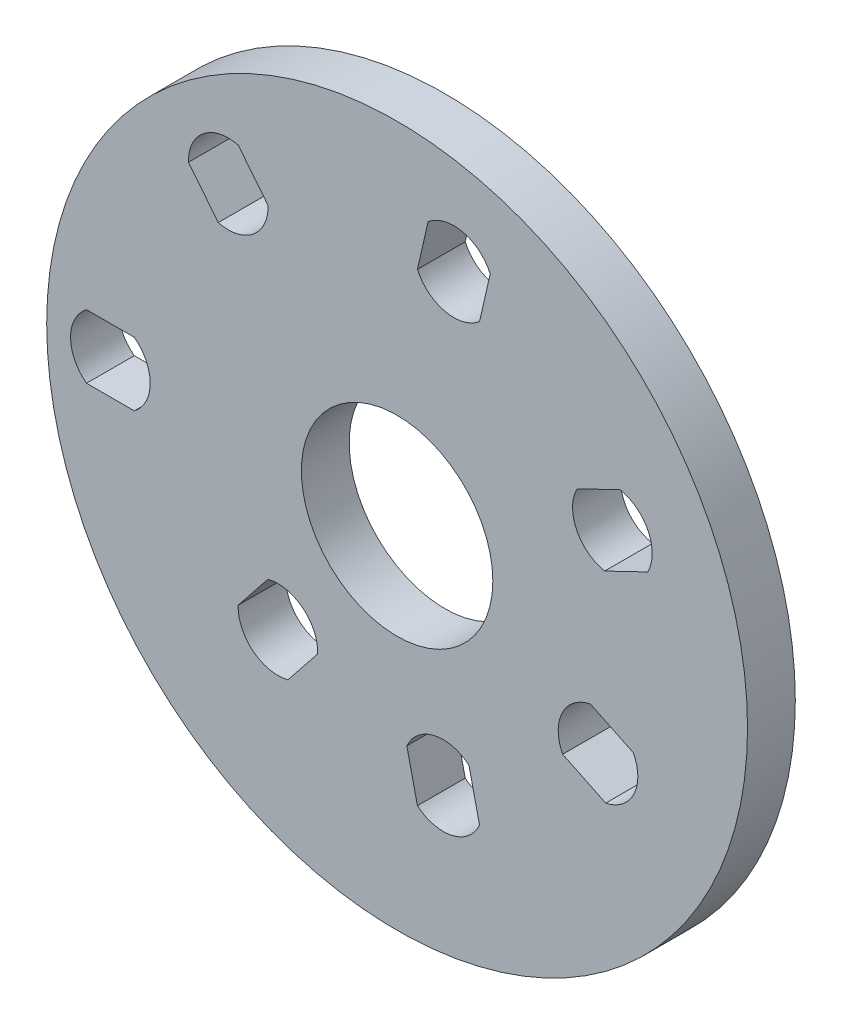
ISO-10303-21;
HEADER;
FILE_DESCRIPTION(('STEP AP214'),'2;1');
FILE_NAME('part.step','',(''),(''),'','','');
FILE_SCHEMA(('AUTOMOTIVE_DESIGN { 1 0 10303 214 1 1 1 1 }'));
ENDSEC;
DATA;
#1=APPLICATION_CONTEXT('core data for automotive mechanical design processes');
#2=APPLICATION_PROTOCOL_DEFINITION('international standard','automotive_design',2000,#1);
#3=PRODUCT_CONTEXT('',#1,'mechanical');
#4=PRODUCT('Part','Part','',(#3));
#5=PRODUCT_RELATED_PRODUCT_CATEGORY('part','',(#4));
#6=PRODUCT_DEFINITION_FORMATION('','',#4);
#7=PRODUCT_DEFINITION_CONTEXT('part definition',#1,'design');
#8=PRODUCT_DEFINITION('design','',#6,#7);
#9=PRODUCT_DEFINITION_SHAPE('','',#8);
#10=(LENGTH_UNIT() NAMED_UNIT(*) SI_UNIT(.MILLI.,.METRE.));
#11=(NAMED_UNIT(*) PLANE_ANGLE_UNIT() SI_UNIT($,.RADIAN.));
#12=(NAMED_UNIT(*) SI_UNIT($,.STERADIAN.) SOLID_ANGLE_UNIT());
#13=UNCERTAINTY_MEASURE_WITH_UNIT(LENGTH_MEASURE(1.E-05),#10,'distance_accuracy_value','');
#14=(GEOMETRIC_REPRESENTATION_CONTEXT(3) GLOBAL_UNCERTAINTY_ASSIGNED_CONTEXT((#13)) GLOBAL_UNIT_ASSIGNED_CONTEXT((#10,
#11,#12)) REPRESENTATION_CONTEXT('',''));
#15=CARTESIAN_POINT('',(0.,0.,0.));
#16=DIRECTION('',(0.,0.,1.));
#17=DIRECTION('',(1.,0.,0.));
#18=AXIS2_PLACEMENT_3D('',#15,#16,#17);
#19=CARTESIAN_POINT('',(-90.,0.,15.));
#20=DIRECTION('',(0.,0.,-1.));
#21=DIRECTION('',(-1.,0.,0.));
#22=AXIS2_PLACEMENT_3D('',#19,#20,#21);
#23=CYLINDRICAL_SURFACE('',#22,12.5);
#24=CARTESIAN_POINT('',(-90.,0.,0.));
#25=DIRECTION('',(0.,0.,1.));
#26=DIRECTION('',(1.,0.,0.));
#27=AXIS2_PLACEMENT_3D('',#24,#25,#26);
#28=CIRCLE('',#27,12.5);
#29=CARTESIAN_POINT('',(-82.4999999999999,-9.99999999999997,0.));
#30=VERTEX_POINT('',#29);
#31=CARTESIAN_POINT('',(-82.5,10.,0.));
#32=VERTEX_POINT('',#31);
#33=EDGE_CURVE('E329',#30,#32,#28,.T.);
#34=ORIENTED_EDGE('',*,*,#33,.F.);
#35=DIRECTION('',(0.,0.,-1.));
#36=VECTOR('',#35,1.);
#37=CARTESIAN_POINT('',(-82.4999999999999,-9.99999999999997,15.));
#38=LINE('',#37,#36);
#39=CARTESIAN_POINT('',(-82.4999999999999,-9.99999999999997,15.));
#40=VERTEX_POINT('',#39);
#41=EDGE_CURVE('E11',#40,#30,#38,.T.);
#42=ORIENTED_EDGE('',*,*,#41,.F.);
#43=CARTESIAN_POINT('',(-90.,0.,15.));
#44=DIRECTION('',(0.,0.,1.));
#45=DIRECTION('',(1.,0.,0.));
#46=AXIS2_PLACEMENT_3D('',#43,#44,#45);
#47=CIRCLE('',#46,12.5);
#48=CARTESIAN_POINT('',(-82.5,10.,15.));
#49=VERTEX_POINT('',#48);
#50=EDGE_CURVE('E245',#40,#49,#47,.T.);
#51=ORIENTED_EDGE('',*,*,#50,.T.);
#52=DIRECTION('',(0.,0.,-1.));
#53=VECTOR('',#52,1.);
#54=CARTESIAN_POINT('',(-82.5,10.,15.));
#55=LINE('',#54,#53);
#56=EDGE_CURVE('E149',#49,#32,#55,.T.);
#57=ORIENTED_EDGE('',*,*,#56,.T.);
#58=EDGE_LOOP('',(#34,#42,#51,#57));
#59=FACE_BOUND('',#58,.T.);
#60=ADVANCED_FACE('F36',(#59),#23,.F.);
#61=CARTESIAN_POINT('',(0.,-9.99999999999997,15.));
#62=DIRECTION('',(0.,1.,0.));
#63=DIRECTION('',(0.,0.,1.));
#64=AXIS2_PLACEMENT_3D('',#61,#62,#63);
#65=PLANE('',#64);
#66=DIRECTION('',(1.,0.,0.));
#67=VECTOR('',#66,1.);
#68=CARTESIAN_POINT('',(0.,-9.99999999999997,0.));
#69=LINE('',#68,#67);
#70=CARTESIAN_POINT('',(-97.5,-9.99999999999997,0.));
#71=VERTEX_POINT('',#70);
#72=EDGE_CURVE('E236',#71,#30,#69,.T.);
#73=ORIENTED_EDGE('',*,*,#72,.F.);
#74=DIRECTION('',(0.,0.,-1.));
#75=VECTOR('',#74,1.);
#76=CARTESIAN_POINT('',(-97.5,-9.99999999999997,15.));
#77=LINE('',#76,#75);
#78=CARTESIAN_POINT('',(-97.5,-9.99999999999997,15.));
#79=VERTEX_POINT('',#78);
#80=EDGE_CURVE('E46',#79,#71,#77,.T.);
#81=ORIENTED_EDGE('',*,*,#80,.F.);
#82=DIRECTION('',(1.,0.,0.));
#83=VECTOR('',#82,1.);
#84=CARTESIAN_POINT('',(0.,-9.99999999999997,15.));
#85=LINE('',#84,#83);
#86=EDGE_CURVE('E234',#79,#40,#85,.T.);
#87=ORIENTED_EDGE('',*,*,#86,.T.);
#88=ORIENTED_EDGE('',*,*,#41,.T.);
#89=EDGE_LOOP('',(#73,#81,#87,#88));
#90=FACE_BOUND('',#89,.T.);
#91=ADVANCED_FACE('F233',(#90),#65,.T.);
#92=CARTESIAN_POINT('',(-90.,0.,15.));
#93=DIRECTION('',(0.,0.,-1.));
#94=DIRECTION('',(-1.,0.,0.));
#95=AXIS2_PLACEMENT_3D('',#92,#93,#94);
#96=CYLINDRICAL_SURFACE('',#95,12.5);
#97=CARTESIAN_POINT('',(-90.,0.,0.));
#98=DIRECTION('',(0.,0.,1.));
#99=DIRECTION('',(1.,0.,0.));
#100=AXIS2_PLACEMENT_3D('',#97,#98,#99);
#101=CIRCLE('',#100,12.5);
#102=CARTESIAN_POINT('',(-97.5,10.,0.));
#103=VERTEX_POINT('',#102);
#104=EDGE_CURVE('E333',#103,#71,#101,.T.);
#105=ORIENTED_EDGE('',*,*,#104,.F.);
#106=DIRECTION('',(0.,0.,-1.));
#107=VECTOR('',#106,1.);
#108=CARTESIAN_POINT('',(-97.5,10.,15.));
#109=LINE('',#108,#107);
#110=CARTESIAN_POINT('',(-97.5,10.,15.));
#111=VERTEX_POINT('',#110);
#112=EDGE_CURVE('E142',#111,#103,#109,.T.);
#113=ORIENTED_EDGE('',*,*,#112,.F.);
#114=CARTESIAN_POINT('',(-90.,0.,15.));
#115=DIRECTION('',(0.,0.,1.));
#116=DIRECTION('',(1.,0.,0.));
#117=AXIS2_PLACEMENT_3D('',#114,#115,#116);
#118=CIRCLE('',#117,12.5);
#119=EDGE_CURVE('E244',#111,#79,#118,.T.);
#120=ORIENTED_EDGE('',*,*,#119,.T.);
#121=ORIENTED_EDGE('',*,*,#80,.T.);
#122=EDGE_LOOP('',(#105,#113,#120,#121));
#123=FACE_BOUND('',#122,.T.);
#124=ADVANCED_FACE('F247',(#123),#96,.F.);
#125=CARTESIAN_POINT('',(17.8016747165094,77.9942329745449,15.));
#126=DIRECTION('',(0.,0.,-1.));
#127=DIRECTION('',(-1.,0.,0.));
#128=AXIS2_PLACEMENT_3D('',#125,#126,#127);
#129=CYLINDRICAL_SURFACE('',#128,12.5);
#130=CARTESIAN_POINT('',(17.8016747165094,77.9942329745449,0.));
#131=DIRECTION('',(0.,0.,1.));
#132=DIRECTION('',(1.,0.,0.));
#133=AXIS2_PLACEMENT_3D('',#130,#131,#132);
#134=CIRCLE('',#133,12.5);
#135=CARTESIAN_POINT('',(6.38348859001858,72.9074829727449,0.));
#136=VERTEX_POINT('',#135);
#137=CARTESIAN_POINT('',(25.8820468336548,68.4570642936177,0.));
#138=VERTEX_POINT('',#137);
#139=EDGE_CURVE('E317',#136,#138,#134,.T.);
#140=ORIENTED_EDGE('',*,*,#139,.F.);
#141=DIRECTION('',(0.,0.,-1.));
#142=VECTOR('',#141,1.);
#143=CARTESIAN_POINT('',(6.38348859001858,72.9074829727449,15.));
#144=LINE('',#143,#142);
#145=CARTESIAN_POINT('',(6.38348859001858,72.9074829727449,15.));
#146=VERTEX_POINT('',#145);
#147=EDGE_CURVE('E342',#146,#136,#144,.T.);
#148=ORIENTED_EDGE('',*,*,#147,.F.);
#149=CARTESIAN_POINT('',(17.8016747165094,77.9942329745449,15.));
#150=DIRECTION('',(0.,0.,1.));
#151=DIRECTION('',(1.,0.,0.));
#152=AXIS2_PLACEMENT_3D('',#149,#150,#151);
#153=CIRCLE('',#152,12.5);
#154=CARTESIAN_POINT('',(25.8820468336548,68.4570642936177,15.));
#155=VERTEX_POINT('',#154);
#156=EDGE_CURVE('E458',#146,#155,#153,.T.);
#157=ORIENTED_EDGE('',*,*,#156,.T.);
#158=DIRECTION('',(0.,0.,-1.));
#159=VECTOR('',#158,1.);
#160=CARTESIAN_POINT('',(25.8820468336548,68.4570642936177,15.));
#161=LINE('',#160,#159);
#162=EDGE_CURVE('E344',#155,#138,#161,.T.);
#163=ORIENTED_EDGE('',*,*,#162,.T.);
#164=EDGE_LOOP('',(#140,#148,#157,#163));
#165=FACE_BOUND('',#164,.T.);
#166=ADVANCED_FACE('F499',(#165),#129,.F.);
#167=CARTESIAN_POINT('',(-9.74927912181804,2.22520933956366,15.));
#168=DIRECTION('',(0.974927912181812,-0.222520933956367,0.));
#169=DIRECTION('',(0.222520933956367,0.974927912181812,0.));
#170=AXIS2_PLACEMENT_3D('',#167,#168,#169);
#171=PLANE('',#170);
#172=DIRECTION('',(-0.222520933956367,-0.974927912181812,0.));
#173=VECTOR('',#172,1.);
#174=CARTESIAN_POINT('',(-9.74927912181804,2.22520933956366,0.));
#175=LINE('',#174,#173);
#176=CARTESIAN_POINT('',(9.7213025993641,87.5314016554722,0.));
#177=VERTEX_POINT('',#176);
#178=EDGE_CURVE('E320',#177,#136,#175,.T.);
#179=ORIENTED_EDGE('',*,*,#178,.F.);
#180=DIRECTION('',(0.,0.,-1.));
#181=VECTOR('',#180,1.);
#182=CARTESIAN_POINT('',(9.7213025993641,87.5314016554722,15.));
#183=LINE('',#182,#181);
#184=CARTESIAN_POINT('',(9.7213025993641,87.5314016554722,15.));
#185=VERTEX_POINT('',#184);
#186=EDGE_CURVE('E349',#185,#177,#183,.T.);
#187=ORIENTED_EDGE('',*,*,#186,.F.);
#188=DIRECTION('',(-0.222520933956367,-0.974927912181812,0.));
#189=VECTOR('',#188,1.);
#190=CARTESIAN_POINT('',(-9.74927912181804,2.22520933956366,15.));
#191=LINE('',#190,#189);
#192=EDGE_CURVE('E461',#185,#146,#191,.T.);
#193=ORIENTED_EDGE('',*,*,#192,.T.);
#194=ORIENTED_EDGE('',*,*,#147,.T.);
#195=EDGE_LOOP('',(#179,#187,#193,#194));
#196=FACE_BOUND('',#195,.T.);
#197=ADVANCED_FACE('F495',(#196),#171,.T.);
#198=CARTESIAN_POINT('',(17.8016747165094,77.9942329745449,15.));
#199=DIRECTION('',(0.,0.,-1.));
#200=DIRECTION('',(-1.,0.,0.));
#201=AXIS2_PLACEMENT_3D('',#198,#199,#200);
#202=CYLINDRICAL_SURFACE('',#201,12.5);
#203=CARTESIAN_POINT('',(17.8016747165094,77.9942329745449,0.));
#204=DIRECTION('',(0.,0.,1.));
#205=DIRECTION('',(1.,0.,0.));
#206=AXIS2_PLACEMENT_3D('',#203,#204,#205);
#207=CIRCLE('',#206,12.5);
#208=CARTESIAN_POINT('',(29.2198608430003,83.0809829763448,0.));
#209=VERTEX_POINT('',#208);
#210=EDGE_CURVE('E323',#209,#177,#207,.T.);
#211=ORIENTED_EDGE('',*,*,#210,.F.);
#212=DIRECTION('',(0.,0.,-1.));
#213=VECTOR('',#212,1.);
#214=CARTESIAN_POINT('',(29.2198608430003,83.0809829763448,15.));
#215=LINE('',#214,#213);
#216=CARTESIAN_POINT('',(29.2198608430003,83.0809829763448,15.));
#217=VERTEX_POINT('',#216);
#218=EDGE_CURVE('E346',#217,#209,#215,.T.);
#219=ORIENTED_EDGE('',*,*,#218,.F.);
#220=CARTESIAN_POINT('',(17.8016747165094,77.9942329745449,15.));
#221=DIRECTION('',(0.,0.,1.));
#222=DIRECTION('',(1.,0.,0.));
#223=AXIS2_PLACEMENT_3D('',#220,#221,#222);
#224=CIRCLE('',#223,12.5);
#225=EDGE_CURVE('E464',#217,#185,#224,.T.);
#226=ORIENTED_EDGE('',*,*,#225,.T.);
#227=ORIENTED_EDGE('',*,*,#186,.T.);
#228=EDGE_LOOP('',(#211,#219,#226,#227));
#229=FACE_BOUND('',#228,.T.);
#230=ADVANCED_FACE('F491',(#229),#202,.F.);
#231=CARTESIAN_POINT('',(-52.9966331579922,66.4556760097826,15.));
#232=DIRECTION('',(0.,0.,-1.));
#233=DIRECTION('',(-1.,0.,0.));
#234=AXIS2_PLACEMENT_3D('',#231,#232,#233);
#235=CYLINDRICAL_SURFACE('',#234,12.5);
#236=CARTESIAN_POINT('',(-52.9966331579922,66.4556760097826,0.));
#237=DIRECTION('',(0.,0.,1.));
#238=DIRECTION('',(1.,0.,0.));
#239=AXIS2_PLACEMENT_3D('',#236,#237,#238);
#240=CIRCLE('',#239,12.5);
#241=CARTESIAN_POINT('',(-56.138774468732,54.3570418726851,0.));
#242=VERTEX_POINT('',#241);
#243=CARTESIAN_POINT('',(-40.5021448193714,66.8268379098598,0.));
#244=VERTEX_POINT('',#243);
#245=EDGE_CURVE('E305',#242,#244,#240,.T.);
#246=ORIENTED_EDGE('',*,*,#245,.F.);
#247=DIRECTION('',(0.,0.,-1.));
#248=VECTOR('',#247,1.);
#249=CARTESIAN_POINT('',(-56.138774468732,54.3570418726851,15.));
#250=LINE('',#249,#248);
#251=CARTESIAN_POINT('',(-56.138774468732,54.3570418726851,15.));
#252=VERTEX_POINT('',#251);
#253=EDGE_CURVE('E347',#252,#242,#250,.T.);
#254=ORIENTED_EDGE('',*,*,#253,.F.);
#255=CARTESIAN_POINT('',(-52.9966331579922,66.4556760097826,15.));
#256=DIRECTION('',(0.,0.,1.));
#257=DIRECTION('',(1.,0.,0.));
#258=AXIS2_PLACEMENT_3D('',#255,#256,#257);
#259=CIRCLE('',#258,12.5);
#260=CARTESIAN_POINT('',(-40.5021448193714,66.8268379098598,15.));
#261=VERTEX_POINT('',#260);
#262=EDGE_CURVE('E447',#252,#261,#259,.T.);
#263=ORIENTED_EDGE('',*,*,#262,.T.);
#264=DIRECTION('',(0.,0.,-1.));
#265=VECTOR('',#264,1.);
#266=CARTESIAN_POINT('',(-40.5021448193714,66.8268379098598,15.));
#267=LINE('',#266,#265);
#268=EDGE_CURVE('E352',#261,#244,#267,.T.);
#269=ORIENTED_EDGE('',*,*,#268,.T.);
#270=EDGE_LOOP('',(#246,#254,#263,#269));
#271=FACE_BOUND('',#270,.T.);
#272=ADVANCED_FACE('F494',(#271),#235,.F.);
#273=CARTESIAN_POINT('',(-7.81831482468028,-6.2348980185873,15.));
#274=DIRECTION('',(0.781831482468031,0.623489801858732,0.));
#275=DIRECTION('',(-0.623489801858732,0.781831482468031,0.));
#276=AXIS2_PLACEMENT_3D('',#273,#274,#275);
#277=PLANE('',#276);
#278=DIRECTION('',(0.623489801858732,-0.781831482468031,0.));
#279=VECTOR('',#278,1.);
#280=CARTESIAN_POINT('',(-7.81831482468028,-6.2348980185873,0.));
#281=LINE('',#280,#279);
#282=CARTESIAN_POINT('',(-65.491121496613,66.0845141097056,0.));
#283=VERTEX_POINT('',#282);
#284=EDGE_CURVE('E308',#283,#242,#281,.T.);
#285=ORIENTED_EDGE('',*,*,#284,.F.);
#286=DIRECTION('',(0.,0.,-1.));
#287=VECTOR('',#286,1.);
#288=CARTESIAN_POINT('',(-65.491121496613,66.0845141097056,15.));
#289=LINE('',#288,#287);
#290=CARTESIAN_POINT('',(-65.491121496613,66.0845141097056,15.));
#291=VERTEX_POINT('',#290);
#292=EDGE_CURVE('E357',#291,#283,#289,.T.);
#293=ORIENTED_EDGE('',*,*,#292,.F.);
#294=DIRECTION('',(0.623489801858732,-0.781831482468031,0.));
#295=VECTOR('',#294,1.);
#296=CARTESIAN_POINT('',(-7.81831482468028,-6.2348980185873,15.));
#297=LINE('',#296,#295);
#298=EDGE_CURVE('E450',#291,#252,#297,.T.);
#299=ORIENTED_EDGE('',*,*,#298,.T.);
#300=ORIENTED_EDGE('',*,*,#253,.T.);
#301=EDGE_LOOP('',(#285,#293,#299,#300));
#302=FACE_BOUND('',#301,.T.);
#303=ADVANCED_FACE('F512',(#302),#277,.T.);
#304=CARTESIAN_POINT('',(-52.9966331579922,66.4556760097826,15.));
#305=DIRECTION('',(0.,0.,-1.));
#306=DIRECTION('',(-1.,0.,0.));
#307=AXIS2_PLACEMENT_3D('',#304,#305,#306);
#308=CYLINDRICAL_SURFACE('',#307,12.5);
#309=CARTESIAN_POINT('',(-52.9966331579922,66.4556760097826,0.));
#310=DIRECTION('',(0.,0.,1.));
#311=DIRECTION('',(1.,0.,0.));
#312=AXIS2_PLACEMENT_3D('',#309,#310,#311);
#313=CIRCLE('',#312,12.5);
#314=CARTESIAN_POINT('',(-49.8544918472524,78.5543101468802,0.));
#315=VERTEX_POINT('',#314);
#316=EDGE_CURVE('E311',#315,#283,#313,.T.);
#317=ORIENTED_EDGE('',*,*,#316,.F.);
#318=DIRECTION('',(0.,0.,-1.));
#319=VECTOR('',#318,1.);
#320=CARTESIAN_POINT('',(-49.8544918472524,78.5543101468802,15.));
#321=LINE('',#320,#319);
#322=CARTESIAN_POINT('',(-49.8544918472524,78.5543101468802,15.));
#323=VERTEX_POINT('',#322);
#324=EDGE_CURVE('E354',#323,#315,#321,.T.);
#325=ORIENTED_EDGE('',*,*,#324,.F.);
#326=CARTESIAN_POINT('',(-52.9966331579922,66.4556760097826,15.));
#327=DIRECTION('',(0.,0.,1.));
#328=DIRECTION('',(1.,0.,0.));
#329=AXIS2_PLACEMENT_3D('',#326,#327,#328);
#330=CIRCLE('',#329,12.5);
#331=EDGE_CURVE('E453',#323,#291,#330,.T.);
#332=ORIENTED_EDGE('',*,*,#331,.T.);
#333=ORIENTED_EDGE('',*,*,#292,.T.);
#334=EDGE_LOOP('',(#317,#325,#332,#333));
#335=FACE_BOUND('',#334,.T.);
#336=ADVANCED_FACE('F508',(#335),#308,.F.);
#337=CARTESIAN_POINT('',(-37.4093881115085,-46.9098889480943,15.));
#338=DIRECTION('',(0.,0.,-1.));
#339=DIRECTION('',(-1.,0.,0.));
#340=AXIS2_PLACEMENT_3D('',#337,#338,#339);
#341=CYLINDRICAL_SURFACE('',#340,12.5);
#342=CARTESIAN_POINT('',(-37.4093881115085,-46.9098889480943,0.));
#343=DIRECTION('',(0.,0.,1.));
#344=DIRECTION('',(1.,0.,0.));
#345=AXIS2_PLACEMENT_3D('',#342,#343,#344);
#346=CIRCLE('',#345,12.5);
#347=CARTESIAN_POINT('',(-49.9038764501294,-46.5387270480214,0.));
#348=VERTEX_POINT('',#347);
#349=CARTESIAN_POINT('',(-34.2672468007646,-59.0085230851907,0.));
#350=VERTEX_POINT('',#349);
#351=EDGE_CURVE('E293',#348,#350,#346,.T.);
#352=ORIENTED_EDGE('',*,*,#351,.F.);
#353=DIRECTION('',(0.,0.,-1.));
#354=VECTOR('',#353,1.);
#355=CARTESIAN_POINT('',(-49.9038764501294,-46.5387270480214,15.));
#356=LINE('',#355,#354);
#357=CARTESIAN_POINT('',(-49.9038764501294,-46.5387270480214,15.));
#358=VERTEX_POINT('',#357);
#359=EDGE_CURVE('E355',#358,#348,#356,.T.);
#360=ORIENTED_EDGE('',*,*,#359,.F.);
#361=CARTESIAN_POINT('',(-37.4093881115085,-46.9098889480943,15.));
#362=DIRECTION('',(0.,0.,1.));
#363=DIRECTION('',(1.,0.,0.));
#364=AXIS2_PLACEMENT_3D('',#361,#362,#363);
#365=CIRCLE('',#364,12.5);
#366=CARTESIAN_POINT('',(-34.2672468007646,-59.0085230851907,15.));
#367=VERTEX_POINT('',#366);
#368=EDGE_CURVE('E436',#358,#367,#365,.T.);
#369=ORIENTED_EDGE('',*,*,#368,.T.);
#370=DIRECTION('',(0.,0.,-1.));
#371=VECTOR('',#370,1.);
#372=CARTESIAN_POINT('',(-34.2672468007646,-59.0085230851907,15.));
#373=LINE('',#372,#371);
#374=EDGE_CURVE('E360',#367,#350,#373,.T.);
#375=ORIENTED_EDGE('',*,*,#374,.T.);
#376=EDGE_LOOP('',(#352,#360,#369,#375));
#377=FACE_BOUND('',#376,.T.);
#378=ADVANCED_FACE('F511',(#377),#341,.F.);
#379=CARTESIAN_POINT('',(-7.81831482468236,6.23489801858473,15.));
#380=DIRECTION('',(0.781831482468237,-0.623489801858473,0.));
#381=DIRECTION('',(0.623489801858474,0.781831482468237,0.));
#382=AXIS2_PLACEMENT_3D('',#379,#380,#381);
#383=PLANE('',#382);
#384=DIRECTION('',(-0.623489801858474,-0.781831482468237,0.));
#385=VECTOR('',#384,1.);
#386=CARTESIAN_POINT('',(-7.81831482468236,6.23489801858473,0.));
#387=LINE('',#386,#385);
#388=CARTESIAN_POINT('',(-40.5515294222523,-34.8112548109978,0.));
#389=VERTEX_POINT('',#388);
#390=EDGE_CURVE('E296',#389,#348,#387,.T.);
#391=ORIENTED_EDGE('',*,*,#390,.F.);
#392=DIRECTION('',(0.,0.,-1.));
#393=VECTOR('',#392,1.);
#394=CARTESIAN_POINT('',(-40.5515294222523,-34.8112548109978,15.));
#395=LINE('',#394,#393);
#396=CARTESIAN_POINT('',(-40.5515294222523,-34.8112548109978,15.));
#397=VERTEX_POINT('',#396);
#398=EDGE_CURVE('E365',#397,#389,#395,.T.);
#399=ORIENTED_EDGE('',*,*,#398,.F.);
#400=DIRECTION('',(-0.623489801858474,-0.781831482468237,0.));
#401=VECTOR('',#400,1.);
#402=CARTESIAN_POINT('',(-7.81831482468236,6.23489801858473,15.));
#403=LINE('',#402,#401);
#404=EDGE_CURVE('E439',#397,#358,#403,.T.);
#405=ORIENTED_EDGE('',*,*,#404,.T.);
#406=ORIENTED_EDGE('',*,*,#359,.T.);
#407=EDGE_LOOP('',(#391,#399,#405,#406));
#408=FACE_BOUND('',#407,.T.);
#409=ADVANCED_FACE('F528',(#408),#383,.T.);
#410=CARTESIAN_POINT('',(-37.4093881115085,-46.9098889480943,15.));
#411=DIRECTION('',(0.,0.,-1.));
#412=DIRECTION('',(-1.,0.,0.));
#413=AXIS2_PLACEMENT_3D('',#410,#411,#412);
#414=CYLINDRICAL_SURFACE('',#413,12.5);
#415=CARTESIAN_POINT('',(-37.4093881115085,-46.9098889480943,0.));
#416=DIRECTION('',(0.,0.,1.));
#417=DIRECTION('',(1.,0.,0.));
#418=AXIS2_PLACEMENT_3D('',#415,#416,#417);
#419=CIRCLE('',#418,12.5);
#420=CARTESIAN_POINT('',(-24.9148997728875,-47.2810508481672,0.));
#421=VERTEX_POINT('',#420);
#422=EDGE_CURVE('E299',#421,#389,#419,.T.);
#423=ORIENTED_EDGE('',*,*,#422,.F.);
#424=DIRECTION('',(0.,0.,-1.));
#425=VECTOR('',#424,1.);
#426=CARTESIAN_POINT('',(-24.9148997728875,-47.2810508481672,15.));
#427=LINE('',#426,#425);
#428=CARTESIAN_POINT('',(-24.9148997728875,-47.2810508481672,15.));
#429=VERTEX_POINT('',#428);
#430=EDGE_CURVE('E362',#429,#421,#427,.T.);
#431=ORIENTED_EDGE('',*,*,#430,.F.);
#432=CARTESIAN_POINT('',(-37.4093881115085,-46.9098889480943,15.));
#433=DIRECTION('',(0.,0.,1.));
#434=DIRECTION('',(1.,0.,0.));
#435=AXIS2_PLACEMENT_3D('',#432,#433,#434);
#436=CIRCLE('',#435,12.5);
#437=EDGE_CURVE('E442',#429,#397,#436,.T.);
#438=ORIENTED_EDGE('',*,*,#437,.T.);
#439=ORIENTED_EDGE('',*,*,#398,.T.);
#440=EDGE_LOOP('',(#423,#431,#438,#439));
#441=FACE_BOUND('',#440,.T.);
#442=ADVANCED_FACE('F524',(#441),#414,.F.);
#443=CARTESIAN_POINT('',(67.5726650926839,32.5412804338117,15.));
#444=DIRECTION('',(0.,0.,-1.));
#445=DIRECTION('',(-1.,0.,0.));
#446=AXIS2_PLACEMENT_3D('',#443,#444,#445);
#447=CYLINDRICAL_SURFACE('',#446,12.5);
#448=CARTESIAN_POINT('',(67.5726650926839,32.5412804338117,0.));
#449=DIRECTION('',(0.,0.,1.));
#450=DIRECTION('',(1.,0.,0.));
#451=AXIS2_PLACEMENT_3D('',#448,#449,#450);
#452=CIRCLE('',#451,12.5);
#453=CARTESIAN_POINT('',(56.4765611922406,38.296841069455,0.));
#454=VERTEX_POINT('',#453);
#455=CARTESIAN_POINT('',(65.1542359745905,20.277463711406,0.));
#456=VERTEX_POINT('',#455);
#457=EDGE_CURVE('E281',#454,#456,#452,.T.);
#458=ORIENTED_EDGE('',*,*,#457,.F.);
#459=DIRECTION('',(0.,0.,-1.));
#460=VECTOR('',#459,1.);
#461=CARTESIAN_POINT('',(56.4765611922406,38.296841069455,15.));
#462=LINE('',#461,#460);
#463=CARTESIAN_POINT('',(56.4765611922406,38.296841069455,15.));
#464=VERTEX_POINT('',#463);
#465=EDGE_CURVE('E363',#464,#454,#462,.T.);
#466=ORIENTED_EDGE('',*,*,#465,.F.);
#467=CARTESIAN_POINT('',(67.5726650926839,32.5412804338117,15.));
#468=DIRECTION('',(0.,0.,1.));
#469=DIRECTION('',(1.,0.,0.));
#470=AXIS2_PLACEMENT_3D('',#467,#468,#469);
#471=CIRCLE('',#470,12.5);
#472=CARTESIAN_POINT('',(65.1542359745905,20.277463711406,15.));
#473=VERTEX_POINT('',#472);
#474=EDGE_CURVE('E425',#464,#473,#471,.T.);
#475=ORIENTED_EDGE('',*,*,#474,.T.);
#476=DIRECTION('',(0.,0.,-1.));
#477=VECTOR('',#476,1.);
#478=CARTESIAN_POINT('',(65.1542359745905,20.277463711406,15.));
#479=LINE('',#478,#477);
#480=EDGE_CURVE('E368',#473,#456,#479,.T.);
#481=ORIENTED_EDGE('',*,*,#480,.T.);
#482=EDGE_LOOP('',(#458,#466,#475,#481));
#483=FACE_BOUND('',#482,.T.);
#484=ADVANCED_FACE('F527',(#483),#447,.F.);
#485=CARTESIAN_POINT('',(-4.33883739117486,9.00968867902446,15.));
#486=DIRECTION('',(0.433883739117489,-0.900968867902452,0.));
#487=DIRECTION('',(0.900968867902452,0.433883739117489,0.));
#488=AXIS2_PLACEMENT_3D('',#485,#486,#487);
#489=PLANE('',#488);
#490=DIRECTION('',(-0.900968867902452,-0.433883739117489,0.));
#491=VECTOR('',#490,1.);
#492=CARTESIAN_POINT('',(-4.33883739117486,9.00968867902446,0.));
#493=LINE('',#492,#491);
#494=CARTESIAN_POINT('',(69.9910942107774,44.8050971562173,0.));
#495=VERTEX_POINT('',#494);
#496=EDGE_CURVE('E284',#495,#454,#493,.T.);
#497=ORIENTED_EDGE('',*,*,#496,.F.);
#498=DIRECTION('',(0.,0.,-1.));
#499=VECTOR('',#498,1.);
#500=CARTESIAN_POINT('',(69.9910942107774,44.8050971562173,15.));
#501=LINE('',#500,#499);
#502=CARTESIAN_POINT('',(69.9910942107774,44.8050971562173,15.));
#503=VERTEX_POINT('',#502);
#504=EDGE_CURVE('E373',#503,#495,#501,.T.);
#505=ORIENTED_EDGE('',*,*,#504,.F.);
#506=DIRECTION('',(-0.900968867902452,-0.433883739117489,0.));
#507=VECTOR('',#506,1.);
#508=CARTESIAN_POINT('',(-4.33883739117486,9.00968867902446,15.));
#509=LINE('',#508,#507);
#510=EDGE_CURVE('E428',#503,#464,#509,.T.);
#511=ORIENTED_EDGE('',*,*,#510,.T.);
#512=ORIENTED_EDGE('',*,*,#465,.T.);
#513=EDGE_LOOP('',(#497,#505,#511,#512));
#514=FACE_BOUND('',#513,.T.);
#515=ADVANCED_FACE('F544',(#514),#489,.T.);
#516=CARTESIAN_POINT('',(67.5726650926839,32.5412804338117,15.));
#517=DIRECTION('',(0.,0.,-1.));
#518=DIRECTION('',(-1.,0.,0.));
#519=AXIS2_PLACEMENT_3D('',#516,#517,#518);
#520=CYLINDRICAL_SURFACE('',#519,12.5);
#521=CARTESIAN_POINT('',(67.5726650926839,32.5412804338117,0.));
#522=DIRECTION('',(0.,0.,1.));
#523=DIRECTION('',(1.,0.,0.));
#524=AXIS2_PLACEMENT_3D('',#521,#522,#523);
#525=CIRCLE('',#524,12.5);
#526=CARTESIAN_POINT('',(78.6687689931272,26.7857197981683,0.));
#527=VERTEX_POINT('',#526);
#528=EDGE_CURVE('E287',#527,#495,#525,.T.);
#529=ORIENTED_EDGE('',*,*,#528,.F.);
#530=DIRECTION('',(0.,0.,-1.));
#531=VECTOR('',#530,1.);
#532=CARTESIAN_POINT('',(78.6687689931272,26.7857197981683,15.));
#533=LINE('',#532,#531);
#534=CARTESIAN_POINT('',(78.6687689931272,26.7857197981683,15.));
#535=VERTEX_POINT('',#534);
#536=EDGE_CURVE('E370',#535,#527,#533,.T.);
#537=ORIENTED_EDGE('',*,*,#536,.F.);
#538=CARTESIAN_POINT('',(67.5726650926839,32.5412804338117,15.));
#539=DIRECTION('',(0.,0.,1.));
#540=DIRECTION('',(1.,0.,0.));
#541=AXIS2_PLACEMENT_3D('',#538,#539,#540);
#542=CIRCLE('',#541,12.5);
#543=EDGE_CURVE('E431',#535,#503,#542,.T.);
#544=ORIENTED_EDGE('',*,*,#543,.T.);
#545=ORIENTED_EDGE('',*,*,#504,.T.);
#546=EDGE_LOOP('',(#529,#537,#544,#545));
#547=FACE_BOUND('',#546,.T.);
#548=ADVANCED_FACE('F540',(#547),#520,.F.);
#549=CARTESIAN_POINT('',(63.067820753174,-30.3718617382192,15.));
#550=DIRECTION('',(0.,0.,-1.));
#551=DIRECTION('',(-1.,0.,0.));
#552=AXIS2_PLACEMENT_3D('',#549,#550,#551);
#553=CYLINDRICAL_SURFACE('',#552,12.5);
#554=CARTESIAN_POINT('',(63.067820753174,-30.3718617382192,0.));
#555=DIRECTION('',(0.,0.,1.));
#556=DIRECTION('',(1.,0.,0.));
#557=AXIS2_PLACEMENT_3D('',#554,#555,#556);
#558=CIRCLE('',#557,12.5);
#559=CARTESIAN_POINT('',(60.6493916350795,-18.1080450158137,0.));
#560=VERTEX_POINT('',#559);
#561=CARTESIAN_POINT('',(51.9717168527312,-36.1274223738635,0.));
#562=VERTEX_POINT('',#561);
#563=EDGE_CURVE('E269',#560,#562,#558,.T.);
#564=ORIENTED_EDGE('',*,*,#563,.F.);
#565=DIRECTION('',(0.,0.,-1.));
#566=VECTOR('',#565,1.);
#567=CARTESIAN_POINT('',(60.6493916350795,-18.1080450158137,15.));
#568=LINE('',#567,#566);
#569=CARTESIAN_POINT('',(60.6493916350795,-18.1080450158137,15.));
#570=VERTEX_POINT('',#569);
#571=EDGE_CURVE('E371',#570,#560,#568,.T.);
#572=ORIENTED_EDGE('',*,*,#571,.F.);
#573=CARTESIAN_POINT('',(63.067820753174,-30.3718617382192,15.));
#574=DIRECTION('',(0.,0.,1.));
#575=DIRECTION('',(1.,0.,0.));
#576=AXIS2_PLACEMENT_3D('',#573,#574,#575);
#577=CIRCLE('',#576,12.5);
#578=CARTESIAN_POINT('',(51.9717168527312,-36.1274223738635,15.));
#579=VERTEX_POINT('',#578);
#580=EDGE_CURVE('E408',#570,#579,#577,.T.);
#581=ORIENTED_EDGE('',*,*,#580,.T.);
#582=DIRECTION('',(0.,0.,-1.));
#583=VECTOR('',#582,1.);
#584=CARTESIAN_POINT('',(51.9717168527312,-36.1274223738635,15.));
#585=LINE('',#584,#583);
#586=EDGE_CURVE('E376',#579,#562,#585,.T.);
#587=ORIENTED_EDGE('',*,*,#586,.T.);
#588=EDGE_LOOP('',(#564,#572,#581,#587));
#589=FACE_BOUND('',#588,.T.);
#590=ADVANCED_FACE('F543',(#589),#553,.F.);
#591=CARTESIAN_POINT('',(4.33883739117415,9.00968867902482,15.));
#592=DIRECTION('',(-0.433883739117417,-0.900968867902487,0.));
#593=DIRECTION('',(0.900968867902487,-0.433883739117417,0.));
#594=AXIS2_PLACEMENT_3D('',#591,#592,#593);
#595=PLANE('',#594);
#596=DIRECTION('',(-0.900968867902487,0.433883739117417,0.));
#597=VECTOR('',#596,1.);
#598=CARTESIAN_POINT('',(4.33883739117415,9.00968867902482,0.));
#599=LINE('',#598,#597);
#600=CARTESIAN_POINT('',(74.1639246536169,-24.616301102575,0.));
#601=VERTEX_POINT('',#600);
#602=EDGE_CURVE('E272',#601,#560,#599,.T.);
#603=ORIENTED_EDGE('',*,*,#602,.F.);
#604=DIRECTION('',(0.,0.,-1.));
#605=VECTOR('',#604,1.);
#606=CARTESIAN_POINT('',(74.1639246536169,-24.616301102575,15.));
#607=LINE('',#606,#605);
#608=CARTESIAN_POINT('',(74.1639246536169,-24.616301102575,15.));
#609=VERTEX_POINT('',#608);
#610=EDGE_CURVE('E380',#609,#601,#607,.T.);
#611=ORIENTED_EDGE('',*,*,#610,.F.);
#612=DIRECTION('',(-0.900968867902487,0.433883739117417,0.));
#613=VECTOR('',#612,1.);
#614=CARTESIAN_POINT('',(4.33883739117415,9.00968867902482,15.));
#615=LINE('',#614,#613);
#616=EDGE_CURVE('E417',#609,#570,#615,.T.);
#617=ORIENTED_EDGE('',*,*,#616,.T.);
#618=ORIENTED_EDGE('',*,*,#571,.T.);
#619=EDGE_LOOP('',(#603,#611,#617,#618));
#620=FACE_BOUND('',#619,.T.);
#621=ADVANCED_FACE('F558',(#620),#595,.T.);
#622=CARTESIAN_POINT('',(63.067820753174,-30.3718617382192,15.));
#623=DIRECTION('',(0.,0.,-1.));
#624=DIRECTION('',(-1.,0.,0.));
#625=AXIS2_PLACEMENT_3D('',#622,#623,#624);
#626=CYLINDRICAL_SURFACE('',#625,12.5);
#627=CARTESIAN_POINT('',(63.067820753174,-30.3718617382192,0.));
#628=DIRECTION('',(0.,0.,1.));
#629=DIRECTION('',(1.,0.,0.));
#630=AXIS2_PLACEMENT_3D('',#627,#628,#629);
#631=CIRCLE('',#630,12.5);
#632=CARTESIAN_POINT('',(65.4862498712685,-42.6356784606247,0.));
#633=VERTEX_POINT('',#632);
#634=EDGE_CURVE('E275',#633,#601,#631,.T.);
#635=ORIENTED_EDGE('',*,*,#634,.F.);
#636=DIRECTION('',(0.,0.,-1.));
#637=VECTOR('',#636,1.);
#638=CARTESIAN_POINT('',(65.4862498712685,-42.6356784606247,15.));
#639=LINE('',#638,#637);
#640=CARTESIAN_POINT('',(65.4862498712685,-42.6356784606247,15.));
#641=VERTEX_POINT('',#640);
#642=EDGE_CURVE('E378',#641,#633,#639,.T.);
#643=ORIENTED_EDGE('',*,*,#642,.F.);
#644=CARTESIAN_POINT('',(63.067820753174,-30.3718617382192,15.));
#645=DIRECTION('',(0.,0.,1.));
#646=DIRECTION('',(1.,0.,0.));
#647=AXIS2_PLACEMENT_3D('',#644,#645,#646);
#648=CIRCLE('',#647,12.5);
#649=EDGE_CURVE('E420',#641,#609,#648,.T.);
#650=ORIENTED_EDGE('',*,*,#649,.T.);
#651=ORIENTED_EDGE('',*,*,#610,.T.);
#652=EDGE_LOOP('',(#635,#643,#650,#651));
#653=FACE_BOUND('',#652,.T.);
#654=ADVANCED_FACE('F555',(#653),#626,.F.);
#655=CARTESIAN_POINT('',(14.4638607071757,-63.3703142918151,15.));
#656=DIRECTION('',(0.,0.,-1.));
#657=DIRECTION('',(-1.,0.,0.));
#658=AXIS2_PLACEMENT_3D('',#655,#656,#657);
#659=CYLINDRICAL_SURFACE('',#658,12.5);
#660=CARTESIAN_POINT('',(14.4638607071757,-63.3703142918151,0.));
#661=DIRECTION('',(0.,0.,1.));
#662=DIRECTION('',(1.,0.,0.));
#663=AXIS2_PLACEMENT_3D('',#660,#661,#662);
#664=CIRCLE('',#663,12.5);
#665=CARTESIAN_POINT('',(6.38348859003211,-72.9074829727439,0.));
#666=VERTEX_POINT('',#665);
#667=CARTESIAN_POINT('',(25.8820468336675,-68.4570642936128,0.));
#668=VERTEX_POINT('',#667);
#669=EDGE_CURVE('E256',#666,#668,#664,.T.);
#670=ORIENTED_EDGE('',*,*,#669,.F.);
#671=DIRECTION('',(0.,0.,-1.));
#672=VECTOR('',#671,1.);
#673=CARTESIAN_POINT('',(6.38348859003211,-72.9074829727439,15.));
#674=LINE('',#673,#672);
#675=CARTESIAN_POINT('',(6.38348859003211,-72.9074829727439,15.));
#676=VERTEX_POINT('',#675);
#677=EDGE_CURVE('E40',#676,#666,#674,.T.);
#678=ORIENTED_EDGE('',*,*,#677,.F.);
#679=CARTESIAN_POINT('',(14.4638607071757,-63.3703142918151,15.));
#680=DIRECTION('',(0.,0.,1.));
#681=DIRECTION('',(1.,0.,0.));
#682=AXIS2_PLACEMENT_3D('',#679,#680,#681);
#683=CIRCLE('',#682,12.5);
#684=CARTESIAN_POINT('',(25.8820468336675,-68.4570642936128,15.));
#685=VERTEX_POINT('',#684);
#686=EDGE_CURVE('E340',#676,#685,#683,.T.);
#687=ORIENTED_EDGE('',*,*,#686,.T.);
#688=DIRECTION('',(0.,0.,-1.));
#689=VECTOR('',#688,1.);
#690=CARTESIAN_POINT('',(25.8820468336675,-68.4570642936128,15.));
#691=LINE('',#690,#689);
#692=EDGE_CURVE('E255',#685,#668,#691,.T.);
#693=ORIENTED_EDGE('',*,*,#692,.T.);
#694=EDGE_LOOP('',(#670,#678,#687,#693));
#695=FACE_BOUND('',#694,.T.);
#696=ADVANCED_FACE('F38',(#695),#659,.F.);
#697=CARTESIAN_POINT('',(-9.74927912181767,-2.22520933956548,15.));
#698=DIRECTION('',(0.97492791218177,0.222520933956548,0.));
#699=DIRECTION('',(-0.222520933956549,0.97492791218177,0.));
#700=AXIS2_PLACEMENT_3D('',#697,#698,#699);
#701=PLANE('',#700);
#702=DIRECTION('',(0.222520933956548,-0.97492791218177,0.));
#703=VECTOR('',#702,1.);
#704=CARTESIAN_POINT('',(-9.74927912181767,-2.22520933956548,0.));
#705=LINE('',#704,#703);
#706=CARTESIAN_POINT('',(3.04567458068387,-58.2835642900173,0.));
#707=VERTEX_POINT('',#706);
#708=EDGE_CURVE('E259',#707,#666,#705,.T.);
#709=ORIENTED_EDGE('',*,*,#708,.F.);
#710=DIRECTION('',(0.,0.,-1.));
#711=VECTOR('',#710,1.);
#712=CARTESIAN_POINT('',(3.04567458068387,-58.2835642900173,15.));
#713=LINE('',#712,#711);
#714=CARTESIAN_POINT('',(3.04567458068387,-58.2835642900173,15.));
#715=VERTEX_POINT('',#714);
#716=EDGE_CURVE('E385',#715,#707,#713,.T.);
#717=ORIENTED_EDGE('',*,*,#716,.F.);
#718=DIRECTION('',(0.222520933956548,-0.97492791218177,0.));
#719=VECTOR('',#718,1.);
#720=CARTESIAN_POINT('',(-9.74927912181767,-2.22520933956548,15.));
#721=LINE('',#720,#719);
#722=EDGE_CURVE('E394',#715,#676,#721,.T.);
#723=ORIENTED_EDGE('',*,*,#722,.T.);
#724=ORIENTED_EDGE('',*,*,#677,.T.);
#725=EDGE_LOOP('',(#709,#717,#723,#724));
#726=FACE_BOUND('',#725,.T.);
#727=ADVANCED_FACE('F392',(#726),#701,.T.);
#728=CARTESIAN_POINT('',(14.4638607071757,-63.3703142918151,15.));
#729=DIRECTION('',(0.,0.,-1.));
#730=DIRECTION('',(-1.,0.,0.));
#731=AXIS2_PLACEMENT_3D('',#728,#729,#730);
#732=CYLINDRICAL_SURFACE('',#731,12.5);
#733=CARTESIAN_POINT('',(14.4638607071757,-63.3703142918151,0.));
#734=DIRECTION('',(0.,0.,1.));
#735=DIRECTION('',(1.,0.,0.));
#736=AXIS2_PLACEMENT_3D('',#733,#734,#735);
#737=CIRCLE('',#736,12.5);
#738=CARTESIAN_POINT('',(22.5442328243193,-53.8331456108863,0.));
#739=VERTEX_POINT('',#738);
#740=EDGE_CURVE('E263',#739,#707,#737,.T.);
#741=ORIENTED_EDGE('',*,*,#740,.F.);
#742=DIRECTION('',(0.,0.,-1.));
#743=VECTOR('',#742,1.);
#744=CARTESIAN_POINT('',(22.5442328243193,-53.8331456108863,15.));
#745=LINE('',#744,#743);
#746=CARTESIAN_POINT('',(22.5442328243193,-53.8331456108863,15.));
#747=VERTEX_POINT('',#746);
#748=EDGE_CURVE('E384',#747,#739,#745,.T.);
#749=ORIENTED_EDGE('',*,*,#748,.F.);
#750=CARTESIAN_POINT('',(14.4638607071757,-63.3703142918151,15.));
#751=DIRECTION('',(0.,0.,1.));
#752=DIRECTION('',(1.,0.,0.));
#753=AXIS2_PLACEMENT_3D('',#750,#751,#752);
#754=CIRCLE('',#753,12.5);
#755=EDGE_CURVE('E403',#747,#715,#754,.T.);
#756=ORIENTED_EDGE('',*,*,#755,.T.);
#757=ORIENTED_EDGE('',*,*,#716,.T.);
#758=EDGE_LOOP('',(#741,#749,#756,#757));
#759=FACE_BOUND('',#758,.T.);
#760=ADVANCED_FACE('F400',(#759),#732,.F.);
#761=CARTESIAN_POINT('',(0.,10.,15.));
#762=DIRECTION('',(0.,1.,0.));
#763=DIRECTION('',(-1.,0.,0.));
#764=AXIS2_PLACEMENT_3D('',#761,#762,#763);
#765=PLANE('',#764);
#766=DIRECTION('',(1.,0.,0.));
#767=VECTOR('',#766,1.);
#768=CARTESIAN_POINT('',(0.,10.,0.));
#769=LINE('',#768,#767);
#770=EDGE_CURVE('E335',#103,#32,#769,.T.);
#771=ORIENTED_EDGE('',*,*,#770,.T.);
#772=ORIENTED_EDGE('',*,*,#56,.F.);
#773=DIRECTION('',(1.,0.,0.));
#774=VECTOR('',#773,1.);
#775=CARTESIAN_POINT('',(0.,10.,15.));
#776=LINE('',#775,#774);
#777=EDGE_CURVE('E55',#111,#49,#776,.T.);
#778=ORIENTED_EDGE('',*,*,#777,.F.);
#779=ORIENTED_EDGE('',*,*,#112,.T.);
#780=EDGE_LOOP('',(#771,#772,#778,#779));
#781=FACE_BOUND('',#780,.T.);
#782=ADVANCED_FACE('F470',(#781),#765,.F.);
#783=CARTESIAN_POINT('',(9.74927912181816,-2.22520933956369,15.));
#784=DIRECTION('',(0.974927912181811,-0.222520933956368,0.));
#785=DIRECTION('',(0.222520933956368,0.974927912181812,0.));
#786=AXIS2_PLACEMENT_3D('',#783,#784,#785);
#787=PLANE('',#786);
#788=DIRECTION('',(-0.222520933956368,-0.974927912181812,0.));
#789=VECTOR('',#788,1.);
#790=CARTESIAN_POINT('',(9.74927912181816,-2.22520933956369,0.));
#791=LINE('',#790,#789);
#792=EDGE_CURVE('E326',#209,#138,#791,.T.);
#793=ORIENTED_EDGE('',*,*,#792,.T.);
#794=ORIENTED_EDGE('',*,*,#162,.F.);
#795=DIRECTION('',(-0.222520933956368,-0.974927912181812,0.));
#796=VECTOR('',#795,1.);
#797=CARTESIAN_POINT('',(9.74927912181816,-2.22520933956369,15.));
#798=LINE('',#797,#796);
#799=EDGE_CURVE('E467',#217,#155,#798,.T.);
#800=ORIENTED_EDGE('',*,*,#799,.F.);
#801=ORIENTED_EDGE('',*,*,#218,.T.);
#802=EDGE_LOOP('',(#793,#794,#800,#801));
#803=FACE_BOUND('',#802,.T.);
#804=ADVANCED_FACE('F472',(#803),#787,.F.);
#805=CARTESIAN_POINT('',(7.81831482468033,6.23489801858734,15.));
#806=DIRECTION('',(0.781831482468031,0.623489801858732,0.));
#807=DIRECTION('',(-0.623489801858732,0.781831482468031,0.));
#808=AXIS2_PLACEMENT_3D('',#805,#806,#807);
#809=PLANE('',#808);
#810=DIRECTION('',(0.623489801858732,-0.781831482468031,0.));
#811=VECTOR('',#810,1.);
#812=CARTESIAN_POINT('',(7.81831482468033,6.23489801858734,0.));
#813=LINE('',#812,#811);
#814=EDGE_CURVE('E314',#315,#244,#813,.T.);
#815=ORIENTED_EDGE('',*,*,#814,.T.);
#816=ORIENTED_EDGE('',*,*,#268,.F.);
#817=DIRECTION('',(0.623489801858732,-0.781831482468031,0.));
#818=VECTOR('',#817,1.);
#819=CARTESIAN_POINT('',(7.81831482468033,6.23489801858734,15.));
#820=LINE('',#819,#818);
#821=EDGE_CURVE('E456',#323,#261,#820,.T.);
#822=ORIENTED_EDGE('',*,*,#821,.F.);
#823=ORIENTED_EDGE('',*,*,#324,.T.);
#824=EDGE_LOOP('',(#815,#816,#822,#823));
#825=FACE_BOUND('',#824,.T.);
#826=ADVANCED_FACE('F478',(#825),#809,.F.);
#827=CARTESIAN_POINT('',(7.81831482468239,-6.23489801858476,15.));
#828=DIRECTION('',(0.781831482468237,-0.623489801858474,0.));
#829=DIRECTION('',(0.623489801858474,0.781831482468237,0.));
#830=AXIS2_PLACEMENT_3D('',#827,#828,#829);
#831=PLANE('',#830);
#832=DIRECTION('',(-0.623489801858474,-0.781831482468237,0.));
#833=VECTOR('',#832,1.);
#834=CARTESIAN_POINT('',(7.81831482468239,-6.23489801858476,0.));
#835=LINE('',#834,#833);
#836=EDGE_CURVE('E302',#421,#350,#835,.T.);
#837=ORIENTED_EDGE('',*,*,#836,.T.);
#838=ORIENTED_EDGE('',*,*,#374,.F.);
#839=DIRECTION('',(-0.623489801858474,-0.781831482468237,0.));
#840=VECTOR('',#839,1.);
#841=CARTESIAN_POINT('',(7.81831482468239,-6.23489801858476,15.));
#842=LINE('',#841,#840);
#843=EDGE_CURVE('E445',#429,#367,#842,.T.);
#844=ORIENTED_EDGE('',*,*,#843,.F.);
#845=ORIENTED_EDGE('',*,*,#430,.T.);
#846=EDGE_LOOP('',(#837,#838,#844,#845));
#847=FACE_BOUND('',#846,.T.);
#848=ADVANCED_FACE('F506',(#847),#831,.F.);
#849=CARTESIAN_POINT('',(4.3388373911749,-9.00968867902455,15.));
#850=DIRECTION('',(0.433883739117489,-0.900968867902452,0.));
#851=DIRECTION('',(0.900968867902452,0.433883739117489,0.));
#852=AXIS2_PLACEMENT_3D('',#849,#850,#851);
#853=PLANE('',#852);
#854=DIRECTION('',(-0.900968867902453,-0.433883739117489,0.));
#855=VECTOR('',#854,1.);
#856=CARTESIAN_POINT('',(4.3388373911749,-9.00968867902455,0.));
#857=LINE('',#856,#855);
#858=EDGE_CURVE('E290',#527,#456,#857,.T.);
#859=ORIENTED_EDGE('',*,*,#858,.T.);
#860=ORIENTED_EDGE('',*,*,#480,.F.);
#861=DIRECTION('',(-0.900968867902453,-0.433883739117489,0.));
#862=VECTOR('',#861,1.);
#863=CARTESIAN_POINT('',(4.3388373911749,-9.00968867902455,15.));
#864=LINE('',#863,#862);
#865=EDGE_CURVE('E434',#535,#473,#864,.T.);
#866=ORIENTED_EDGE('',*,*,#865,.F.);
#867=ORIENTED_EDGE('',*,*,#536,.T.);
#868=EDGE_LOOP('',(#859,#860,#866,#867));
#869=FACE_BOUND('',#868,.T.);
#870=ADVANCED_FACE('F522',(#869),#853,.F.);
#871=CARTESIAN_POINT('',(-4.33883739117418,-9.00968867902489,15.));
#872=DIRECTION('',(-0.433883739117418,-0.900968867902487,0.));
#873=DIRECTION('',(0.900968867902487,-0.433883739117418,0.));
#874=AXIS2_PLACEMENT_3D('',#871,#872,#873);
#875=PLANE('',#874);
#876=DIRECTION('',(-0.900968867902487,0.433883739117418,0.));
#877=VECTOR('',#876,1.);
#878=CARTESIAN_POINT('',(-4.33883739117418,-9.00968867902489,0.));
#879=LINE('',#878,#877);
#880=EDGE_CURVE('E278',#633,#562,#879,.T.);
#881=ORIENTED_EDGE('',*,*,#880,.T.);
#882=ORIENTED_EDGE('',*,*,#586,.F.);
#883=DIRECTION('',(-0.900968867902487,0.433883739117418,0.));
#884=VECTOR('',#883,1.);
#885=CARTESIAN_POINT('',(-4.33883739117418,-9.00968867902489,15.));
#886=LINE('',#885,#884);
#887=EDGE_CURVE('E423',#641,#579,#886,.T.);
#888=ORIENTED_EDGE('',*,*,#887,.F.);
#889=ORIENTED_EDGE('',*,*,#642,.T.);
#890=EDGE_LOOP('',(#881,#882,#888,#889));
#891=FACE_BOUND('',#890,.T.);
#892=ADVANCED_FACE('F538',(#891),#875,.F.);
#893=CARTESIAN_POINT('',(9.74927912181773,2.22520933956549,15.));
#894=DIRECTION('',(0.97492791218177,0.222520933956549,0.));
#895=DIRECTION('',(-0.222520933956549,0.97492791218177,0.));
#896=AXIS2_PLACEMENT_3D('',#893,#894,#895);
#897=PLANE('',#896);
#898=DIRECTION('',(0.222520933956549,-0.97492791218177,0.));
#899=VECTOR('',#898,1.);
#900=CARTESIAN_POINT('',(9.74927912181773,2.22520933956549,0.));
#901=LINE('',#900,#899);
#902=EDGE_CURVE('E266',#739,#668,#901,.T.);
#903=ORIENTED_EDGE('',*,*,#902,.T.);
#904=ORIENTED_EDGE('',*,*,#692,.F.);
#905=DIRECTION('',(0.222520933956549,-0.97492791218177,0.));
#906=VECTOR('',#905,1.);
#907=CARTESIAN_POINT('',(9.74927912181773,2.22520933956549,15.));
#908=LINE('',#907,#906);
#909=EDGE_CURVE('E405',#747,#685,#908,.T.);
#910=ORIENTED_EDGE('',*,*,#909,.F.);
#911=ORIENTED_EDGE('',*,*,#748,.T.);
#912=EDGE_LOOP('',(#903,#904,#910,#911));
#913=FACE_BOUND('',#912,.T.);
#914=ADVANCED_FACE('F406',(#913),#897,.F.);
#915=CARTESIAN_POINT('',(0.,0.,15.));
#916=DIRECTION('',(0.,0.,-1.));
#917=DIRECTION('',(-1.,0.,0.));
#918=AXIS2_PLACEMENT_3D('',#915,#916,#917);
#919=CYLINDRICAL_SURFACE('',#918,110.);
#920=CARTESIAN_POINT('',(0.,0.,15.));
#921=DIRECTION('',(0.,0.,1.));
#922=DIRECTION('',(1.,0.,0.));
#923=AXIS2_PLACEMENT_3D('',#920,#921,#922);
#924=CIRCLE('',#923,110.);
#925=CARTESIAN_POINT('',(110.,0.,15.));
#926=VERTEX_POINT('',#925);
#927=EDGE_CURVE('E249',#926,#926,#924,.T.);
#928=ORIENTED_EDGE('',*,*,#927,.F.);
#929=EDGE_LOOP('',(#928));
#930=FACE_BOUND('',#929,.T.);
#931=CARTESIAN_POINT('',(0.,0.,0.));
#932=DIRECTION('',(0.,0.,1.));
#933=DIRECTION('',(1.,0.,0.));
#934=AXIS2_PLACEMENT_3D('',#931,#932,#933);
#935=CIRCLE('',#934,110.);
#936=CARTESIAN_POINT('',(110.,0.,0.));
#937=VERTEX_POINT('',#936);
#938=EDGE_CURVE('E337',#937,#937,#935,.T.);
#939=ORIENTED_EDGE('',*,*,#938,.T.);
#940=EDGE_LOOP('',(#939));
#941=FACE_BOUND('',#940,.T.);
#942=ADVANCED_FACE('F567',(#930,#941),#919,.T.);
#943=CARTESIAN_POINT('',(0.,0.,15.));
#944=DIRECTION('',(0.,0.,1.));
#945=DIRECTION('',(1.,0.,0.));
#946=AXIS2_PLACEMENT_3D('',#943,#944,#945);
#947=PLANE('',#946);
#948=CARTESIAN_POINT('',(0.,0.,15.));
#949=DIRECTION('',(0.,0.,1.));
#950=DIRECTION('',(1.,0.,0.));
#951=AXIS2_PLACEMENT_3D('',#948,#949,#950);
#952=CIRCLE('',#951,30.05);
#953=CARTESIAN_POINT('',(30.05,0.,15.));
#954=VERTEX_POINT('',#953);
#955=EDGE_CURVE('E753',#954,#954,#952,.T.);
#956=ORIENTED_EDGE('',*,*,#955,.F.);
#957=EDGE_LOOP('',(#956));
#958=FACE_BOUND('',#957,.T.);
#959=ORIENTED_EDGE('',*,*,#686,.F.);
#960=ORIENTED_EDGE('',*,*,#722,.F.);
#961=ORIENTED_EDGE('',*,*,#755,.F.);
#962=ORIENTED_EDGE('',*,*,#909,.T.);
#963=EDGE_LOOP('',(#959,#960,#961,#962));
#964=FACE_BOUND('',#963,.T.);
#965=ORIENTED_EDGE('',*,*,#580,.F.);
#966=ORIENTED_EDGE('',*,*,#616,.F.);
#967=ORIENTED_EDGE('',*,*,#649,.F.);
#968=ORIENTED_EDGE('',*,*,#887,.T.);
#969=EDGE_LOOP('',(#965,#966,#967,#968));
#970=FACE_BOUND('',#969,.T.);
#971=ORIENTED_EDGE('',*,*,#474,.F.);
#972=ORIENTED_EDGE('',*,*,#510,.F.);
#973=ORIENTED_EDGE('',*,*,#543,.F.);
#974=ORIENTED_EDGE('',*,*,#865,.T.);
#975=EDGE_LOOP('',(#971,#972,#973,#974));
#976=FACE_BOUND('',#975,.T.);
#977=ORIENTED_EDGE('',*,*,#368,.F.);
#978=ORIENTED_EDGE('',*,*,#404,.F.);
#979=ORIENTED_EDGE('',*,*,#437,.F.);
#980=ORIENTED_EDGE('',*,*,#843,.T.);
#981=EDGE_LOOP('',(#977,#978,#979,#980));
#982=FACE_BOUND('',#981,.T.);
#983=ORIENTED_EDGE('',*,*,#262,.F.);
#984=ORIENTED_EDGE('',*,*,#298,.F.);
#985=ORIENTED_EDGE('',*,*,#331,.F.);
#986=ORIENTED_EDGE('',*,*,#821,.T.);
#987=EDGE_LOOP('',(#983,#984,#985,#986));
#988=FACE_BOUND('',#987,.T.);
#989=ORIENTED_EDGE('',*,*,#156,.F.);
#990=ORIENTED_EDGE('',*,*,#192,.F.);
#991=ORIENTED_EDGE('',*,*,#225,.F.);
#992=ORIENTED_EDGE('',*,*,#799,.T.);
#993=EDGE_LOOP('',(#989,#990,#991,#992));
#994=FACE_BOUND('',#993,.T.);
#995=ORIENTED_EDGE('',*,*,#50,.F.);
#996=ORIENTED_EDGE('',*,*,#86,.F.);
#997=ORIENTED_EDGE('',*,*,#119,.F.);
#998=ORIENTED_EDGE('',*,*,#777,.T.);
#999=EDGE_LOOP('',(#995,#996,#997,#998));
#1000=FACE_BOUND('',#999,.T.);
#1001=ORIENTED_EDGE('',*,*,#927,.T.);
#1002=EDGE_LOOP('',(#1001));
#1003=FACE_BOUND('',#1002,.T.);
#1004=ADVANCED_FACE('F242',(#958,#964,#970,#976,#982,#988,#994,#1000,#1003),#947,.T.);
#1005=CARTESIAN_POINT('',(0.,0.,0.));
#1006=DIRECTION('',(0.,0.,1.));
#1007=DIRECTION('',(1.,0.,0.));
#1008=AXIS2_PLACEMENT_3D('',#1005,#1006,#1007);
#1009=PLANE('',#1008);
#1010=CARTESIAN_POINT('',(0.,0.,0.));
#1011=DIRECTION('',(0.,0.,1.));
#1012=DIRECTION('',(1.,0.,0.));
#1013=AXIS2_PLACEMENT_3D('',#1010,#1011,#1012);
#1014=CIRCLE('',#1013,30.05);
#1015=CARTESIAN_POINT('',(30.05,0.,0.));
#1016=VERTEX_POINT('',#1015);
#1017=EDGE_CURVE('E260',#1016,#1016,#1014,.F.);
#1018=ORIENTED_EDGE('',*,*,#1017,.F.);
#1019=EDGE_LOOP('',(#1018));
#1020=FACE_BOUND('',#1019,.T.);
#1021=ORIENTED_EDGE('',*,*,#669,.T.);
#1022=ORIENTED_EDGE('',*,*,#902,.F.);
#1023=ORIENTED_EDGE('',*,*,#740,.T.);
#1024=ORIENTED_EDGE('',*,*,#708,.T.);
#1025=EDGE_LOOP('',(#1021,#1022,#1023,#1024));
#1026=FACE_BOUND('',#1025,.T.);
#1027=ORIENTED_EDGE('',*,*,#563,.T.);
#1028=ORIENTED_EDGE('',*,*,#880,.F.);
#1029=ORIENTED_EDGE('',*,*,#634,.T.);
#1030=ORIENTED_EDGE('',*,*,#602,.T.);
#1031=EDGE_LOOP('',(#1027,#1028,#1029,#1030));
#1032=FACE_BOUND('',#1031,.T.);
#1033=ORIENTED_EDGE('',*,*,#457,.T.);
#1034=ORIENTED_EDGE('',*,*,#858,.F.);
#1035=ORIENTED_EDGE('',*,*,#528,.T.);
#1036=ORIENTED_EDGE('',*,*,#496,.T.);
#1037=EDGE_LOOP('',(#1033,#1034,#1035,#1036));
#1038=FACE_BOUND('',#1037,.T.);
#1039=ORIENTED_EDGE('',*,*,#351,.T.);
#1040=ORIENTED_EDGE('',*,*,#836,.F.);
#1041=ORIENTED_EDGE('',*,*,#422,.T.);
#1042=ORIENTED_EDGE('',*,*,#390,.T.);
#1043=EDGE_LOOP('',(#1039,#1040,#1041,#1042));
#1044=FACE_BOUND('',#1043,.T.);
#1045=ORIENTED_EDGE('',*,*,#245,.T.);
#1046=ORIENTED_EDGE('',*,*,#814,.F.);
#1047=ORIENTED_EDGE('',*,*,#316,.T.);
#1048=ORIENTED_EDGE('',*,*,#284,.T.);
#1049=EDGE_LOOP('',(#1045,#1046,#1047,#1048));
#1050=FACE_BOUND('',#1049,.T.);
#1051=ORIENTED_EDGE('',*,*,#139,.T.);
#1052=ORIENTED_EDGE('',*,*,#792,.F.);
#1053=ORIENTED_EDGE('',*,*,#210,.T.);
#1054=ORIENTED_EDGE('',*,*,#178,.T.);
#1055=EDGE_LOOP('',(#1051,#1052,#1053,#1054));
#1056=FACE_BOUND('',#1055,.T.);
#1057=ORIENTED_EDGE('',*,*,#33,.T.);
#1058=ORIENTED_EDGE('',*,*,#770,.F.);
#1059=ORIENTED_EDGE('',*,*,#104,.T.);
#1060=ORIENTED_EDGE('',*,*,#72,.T.);
#1061=EDGE_LOOP('',(#1057,#1058,#1059,#1060));
#1062=FACE_BOUND('',#1061,.T.);
#1063=ORIENTED_EDGE('',*,*,#938,.F.);
#1064=EDGE_LOOP('',(#1063));
#1065=FACE_BOUND('',#1064,.T.);
#1066=ADVANCED_FACE('F398',(#1020,#1026,#1032,#1038,#1044,#1050,#1056,#1062,#1065),#1009,.F.);
#1067=CARTESIAN_POINT('',(0.,0.,-0.000999999999999265));
#1068=DIRECTION('',(0.,0.,1.));
#1069=DIRECTION('',(1.,0.,0.));
#1070=AXIS2_PLACEMENT_3D('',#1067,#1068,#1069);
#1071=CYLINDRICAL_SURFACE('',#1070,30.05);
#1072=ORIENTED_EDGE('',*,*,#955,.T.);
#1073=EDGE_LOOP('',(#1072));
#1074=FACE_BOUND('',#1073,.T.);
#1075=ORIENTED_EDGE('',*,*,#1017,.T.);
#1076=EDGE_LOOP('',(#1075));
#1077=FACE_BOUND('',#1076,.T.);
#1078=ADVANCED_FACE('F737',(#1074,#1077),#1071,.F.);
#1079=CLOSED_SHELL('',(#60,#91,#124,#166,#197,#230,#272,#303,#336,#378,#409,#442,#484,#515,#548,
#590,#621,#654,#696,#727,#760,#782,#804,#826,#848,#870,#892,#914,#942,#1004,#1066,#1078));
#1080=MANIFOLD_SOLID_BREP('B2',#1079);
#1081=ADVANCED_BREP_SHAPE_REPRESENTATION('',(#18,#1080),#14);
#1082=SHAPE_DEFINITION_REPRESENTATION(#9,#1081);
ENDSEC;
END-ISO-10303-21;
